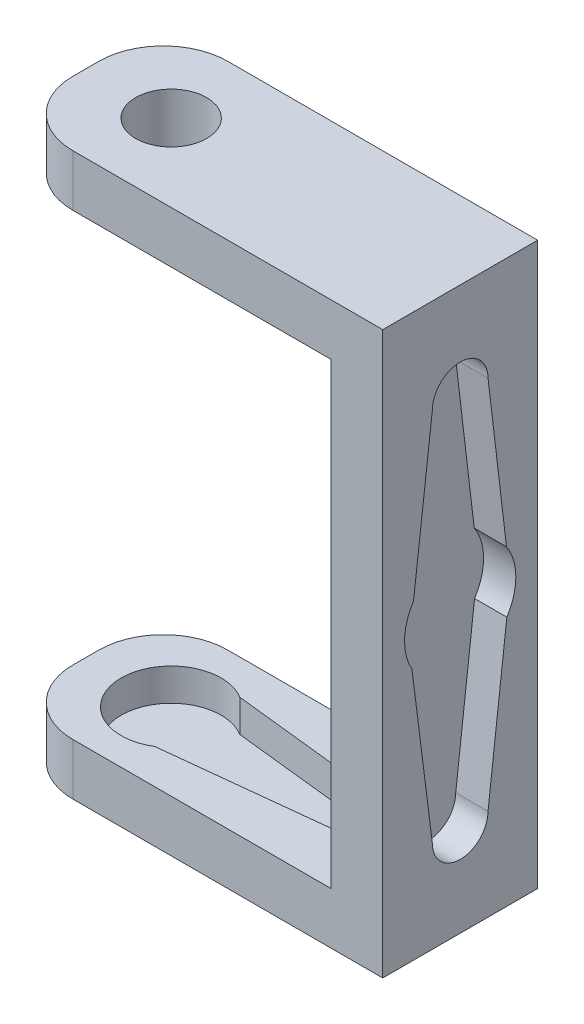
ISO-10303-21;
HEADER;
FILE_DESCRIPTION(('STEP AP214'),'2;1');
FILE_NAME('part.step','',(''),(''),'','','');
FILE_SCHEMA(('AUTOMOTIVE_DESIGN { 1 0 10303 214 1 1 1 1 }'));
ENDSEC;
DATA;
#1=APPLICATION_CONTEXT('core data for automotive mechanical design processes');
#2=APPLICATION_PROTOCOL_DEFINITION('international standard','automotive_design',2000,#1);
#3=PRODUCT_CONTEXT('',#1,'mechanical');
#4=PRODUCT('Part','Part','',(#3));
#5=PRODUCT_RELATED_PRODUCT_CATEGORY('part','',(#4));
#6=PRODUCT_DEFINITION_FORMATION('','',#4);
#7=PRODUCT_DEFINITION_CONTEXT('part definition',#1,'design');
#8=PRODUCT_DEFINITION('design','',#6,#7);
#9=PRODUCT_DEFINITION_SHAPE('','',#8);
#10=(LENGTH_UNIT() NAMED_UNIT(*) SI_UNIT(.MILLI.,.METRE.));
#11=(NAMED_UNIT(*) PLANE_ANGLE_UNIT() SI_UNIT($,.RADIAN.));
#12=(NAMED_UNIT(*) SI_UNIT($,.STERADIAN.) SOLID_ANGLE_UNIT());
#13=UNCERTAINTY_MEASURE_WITH_UNIT(LENGTH_MEASURE(1.E-05),#10,'distance_accuracy_value','');
#14=(GEOMETRIC_REPRESENTATION_CONTEXT(3) GLOBAL_UNCERTAINTY_ASSIGNED_CONTEXT((#13)) GLOBAL_UNIT_ASSIGNED_CONTEXT((#10,
#11,#12)) REPRESENTATION_CONTEXT('',''));
#15=CARTESIAN_POINT('',(0.,0.,0.));
#16=DIRECTION('',(0.,0.,1.));
#17=DIRECTION('',(1.,0.,0.));
#18=AXIS2_PLACEMENT_3D('',#15,#16,#17);
#19=CARTESIAN_POINT('',(-6.60918624296569,-4.,-6.));
#20=DIRECTION('',(-1.,0.,0.));
#21=DIRECTION('',(0.,0.,1.));
#22=AXIS2_PLACEMENT_3D('',#19,#20,#21);
#23=PLANE('',#22);
#24=DIRECTION('',(0.,0.,1.));
#25=VECTOR('',#24,1.);
#26=CARTESIAN_POINT('',(-6.60918624296569,-4.,-6.));
#27=LINE('',#26,#25);
#28=CARTESIAN_POINT('',(-6.60918624296569,-4.,-0.999999999999999));
#29=VERTEX_POINT('',#28);
#30=CARTESIAN_POINT('',(-6.60918624296569,-4.,1.));
#31=VERTEX_POINT('',#30);
#32=EDGE_CURVE('E340',#29,#31,#27,.T.);
#33=ORIENTED_EDGE('',*,*,#32,.T.);
#34=DIRECTION('',(0.,1.,0.));
#35=VECTOR('',#34,1.);
#36=CARTESIAN_POINT('',(-6.60918624296569,-4.,1.));
#37=LINE('',#36,#35);
#38=CARTESIAN_POINT('',(-6.60918624296569,0.,1.));
#39=VERTEX_POINT('',#38);
#40=EDGE_CURVE('E382',#31,#39,#37,.T.);
#41=ORIENTED_EDGE('',*,*,#40,.T.);
#42=DIRECTION('',(0.,0.,1.));
#43=VECTOR('',#42,1.);
#44=CARTESIAN_POINT('',(-6.60918624296569,0.,-6.));
#45=LINE('',#44,#43);
#46=CARTESIAN_POINT('',(-6.60918624296569,0.,-0.999999999999999));
#47=VERTEX_POINT('',#46);
#48=EDGE_CURVE('E333',#47,#39,#45,.T.);
#49=ORIENTED_EDGE('',*,*,#48,.F.);
#50=DIRECTION('',(0.,1.,0.));
#51=VECTOR('',#50,1.);
#52=CARTESIAN_POINT('',(-6.60918624296569,-4.,-0.999999999999999));
#53=LINE('',#52,#51);
#54=EDGE_CURVE('E380',#47,#29,#53,.F.);
#55=ORIENTED_EDGE('',*,*,#54,.T.);
#56=EDGE_LOOP('',(#33,#41,#49,#55));
#57=FACE_BOUND('',#56,.T.);
#58=ADVANCED_FACE('F33',(#57),#23,.T.);
#59=CARTESIAN_POINT('',(-6.60918624296569,-4.,-6.));
#60=DIRECTION('',(0.,0.,-1.));
#61=DIRECTION('',(-1.,0.,0.));
#62=AXIS2_PLACEMENT_3D('',#59,#60,#61);
#63=PLANE('',#62);
#64=DIRECTION('',(-1.,0.,0.));
#65=VECTOR('',#64,1.);
#66=CARTESIAN_POINT('',(18.3908137570343,35.5,-6.));
#67=LINE('',#66,#65);
#68=CARTESIAN_POINT('',(18.3908137570343,35.5,-6.));
#69=VERTEX_POINT('',#68);
#70=CARTESIAN_POINT('',(-1.60918624296568,35.5,-6.));
#71=VERTEX_POINT('',#70);
#72=EDGE_CURVE('E280',#69,#71,#67,.T.);
#73=ORIENTED_EDGE('',*,*,#72,.T.);
#74=DIRECTION('',(0.,1.,0.));
#75=VECTOR('',#74,1.);
#76=CARTESIAN_POINT('',(-1.60918624296569,-4.,-6.));
#77=LINE('',#76,#75);
#78=CARTESIAN_POINT('',(-1.60918624296568,39.5,-6.));
#79=VERTEX_POINT('',#78);
#80=EDGE_CURVE('E377',#71,#79,#77,.T.);
#81=ORIENTED_EDGE('',*,*,#80,.T.);
#82=DIRECTION('',(1.,0.,0.));
#83=VECTOR('',#82,1.);
#84=CARTESIAN_POINT('',(18.3908137570343,39.5,-6.));
#85=LINE('',#84,#83);
#86=CARTESIAN_POINT('',(22.3908137570343,39.5,-6.));
#87=VERTEX_POINT('',#86);
#88=EDGE_CURVE('E286',#79,#87,#85,.T.);
#89=ORIENTED_EDGE('',*,*,#88,.T.);
#90=DIRECTION('',(0.,-1.,0.));
#91=VECTOR('',#90,1.);
#92=CARTESIAN_POINT('',(22.3908137570343,39.5,-6.));
#93=LINE('',#92,#91);
#94=CARTESIAN_POINT('',(22.3908137570343,-4.,-6.));
#95=VERTEX_POINT('',#94);
#96=EDGE_CURVE('E304',#87,#95,#93,.T.);
#97=ORIENTED_EDGE('',*,*,#96,.T.);
#98=DIRECTION('',(-1.,0.,0.));
#99=VECTOR('',#98,1.);
#100=CARTESIAN_POINT('',(-6.60918624296569,-4.,-6.));
#101=LINE('',#100,#99);
#102=CARTESIAN_POINT('',(-1.60918624296569,-4.,-6.));
#103=VERTEX_POINT('',#102);
#104=EDGE_CURVE('E345',#95,#103,#101,.T.);
#105=ORIENTED_EDGE('',*,*,#104,.T.);
#106=DIRECTION('',(0.,1.,0.));
#107=VECTOR('',#106,1.);
#108=CARTESIAN_POINT('',(-1.60918624296569,-4.,-6.));
#109=LINE('',#108,#107);
#110=CARTESIAN_POINT('',(-1.60918624296569,0.,-6.));
#111=VERTEX_POINT('',#110);
#112=EDGE_CURVE('E374',#103,#111,#109,.T.);
#113=ORIENTED_EDGE('',*,*,#112,.T.);
#114=DIRECTION('',(-1.,0.,0.));
#115=VECTOR('',#114,1.);
#116=CARTESIAN_POINT('',(-6.60918624296569,0.,-6.));
#117=LINE('',#116,#115);
#118=CARTESIAN_POINT('',(18.3908137570343,0.,-6.));
#119=VERTEX_POINT('',#118);
#120=EDGE_CURVE('E343',#119,#111,#117,.T.);
#121=ORIENTED_EDGE('',*,*,#120,.F.);
#122=DIRECTION('',(0.,-1.,0.));
#123=VECTOR('',#122,1.);
#124=CARTESIAN_POINT('',(18.3908137570343,39.5,-6.));
#125=LINE('',#124,#123);
#126=EDGE_CURVE('E294',#69,#119,#125,.T.);
#127=ORIENTED_EDGE('',*,*,#126,.F.);
#128=EDGE_LOOP('',(#73,#81,#89,#97,#105,#113,#121,#127));
#129=FACE_BOUND('',#128,.T.);
#130=ADVANCED_FACE('F394',(#129),#63,.T.);
#131=CARTESIAN_POINT('',(-6.60918624296569,-4.,6.));
#132=DIRECTION('',(0.,0.,1.));
#133=DIRECTION('',(1.,0.,0.));
#134=AXIS2_PLACEMENT_3D('',#131,#132,#133);
#135=PLANE('',#134);
#136=DIRECTION('',(-1.,0.,0.));
#137=VECTOR('',#136,1.);
#138=CARTESIAN_POINT('',(18.3908137570343,39.5,6.));
#139=LINE('',#138,#137);
#140=CARTESIAN_POINT('',(22.3908137570343,39.5,6.));
#141=VERTEX_POINT('',#140);
#142=CARTESIAN_POINT('',(-1.60918624296568,39.5,6.));
#143=VERTEX_POINT('',#142);
#144=EDGE_CURVE('E291',#141,#143,#139,.T.);
#145=ORIENTED_EDGE('',*,*,#144,.T.);
#146=DIRECTION('',(0.,1.,0.));
#147=VECTOR('',#146,1.);
#148=CARTESIAN_POINT('',(-1.60918624296569,-4.,6.));
#149=LINE('',#148,#147);
#150=CARTESIAN_POINT('',(-1.60918624296568,35.5,6.));
#151=VERTEX_POINT('',#150);
#152=EDGE_CURVE('E368',#143,#151,#149,.F.);
#153=ORIENTED_EDGE('',*,*,#152,.T.);
#154=DIRECTION('',(-1.,0.,0.));
#155=VECTOR('',#154,1.);
#156=CARTESIAN_POINT('',(18.3908137570343,35.5,6.));
#157=LINE('',#156,#155);
#158=CARTESIAN_POINT('',(18.3908137570343,35.5,6.));
#159=VERTEX_POINT('',#158);
#160=EDGE_CURVE('E274',#159,#151,#157,.T.);
#161=ORIENTED_EDGE('',*,*,#160,.F.);
#162=DIRECTION('',(0.,-1.,0.));
#163=VECTOR('',#162,1.);
#164=CARTESIAN_POINT('',(18.3908137570343,39.5,6.));
#165=LINE('',#164,#163);
#166=CARTESIAN_POINT('',(18.3908137570343,0.,6.));
#167=VERTEX_POINT('',#166);
#168=EDGE_CURVE('E297',#159,#167,#165,.T.);
#169=ORIENTED_EDGE('',*,*,#168,.T.);
#170=DIRECTION('',(1.,0.,0.));
#171=VECTOR('',#170,1.);
#172=CARTESIAN_POINT('',(-6.60918624296569,0.,6.));
#173=LINE('',#172,#171);
#174=CARTESIAN_POINT('',(-1.60918624296569,0.,6.));
#175=VERTEX_POINT('',#174);
#176=EDGE_CURVE('E351',#175,#167,#173,.T.);
#177=ORIENTED_EDGE('',*,*,#176,.F.);
#178=DIRECTION('',(0.,1.,0.));
#179=VECTOR('',#178,1.);
#180=CARTESIAN_POINT('',(-1.60918624296569,-4.,6.));
#181=LINE('',#180,#179);
#182=CARTESIAN_POINT('',(-1.60918624296569,-4.,6.));
#183=VERTEX_POINT('',#182);
#184=EDGE_CURVE('E366',#175,#183,#181,.F.);
#185=ORIENTED_EDGE('',*,*,#184,.T.);
#186=DIRECTION('',(1.,0.,0.));
#187=VECTOR('',#186,1.);
#188=CARTESIAN_POINT('',(-6.60918624296569,-4.,6.));
#189=LINE('',#188,#187);
#190=CARTESIAN_POINT('',(22.3908137570343,-4.,6.));
#191=VERTEX_POINT('',#190);
#192=EDGE_CURVE('E342',#183,#191,#189,.T.);
#193=ORIENTED_EDGE('',*,*,#192,.T.);
#194=DIRECTION('',(0.,-1.,0.));
#195=VECTOR('',#194,1.);
#196=CARTESIAN_POINT('',(22.3908137570343,39.5,6.));
#197=LINE('',#196,#195);
#198=EDGE_CURVE('E301',#141,#191,#197,.T.);
#199=ORIENTED_EDGE('',*,*,#198,.F.);
#200=EDGE_LOOP('',(#145,#153,#161,#169,#177,#185,#193,#199));
#201=FACE_BOUND('',#200,.T.);
#202=ADVANCED_FACE('F408',(#201),#135,.T.);
#203=CARTESIAN_POINT('',(0.,-4.,0.));
#204=DIRECTION('',(0.,1.,0.));
#205=DIRECTION('',(0.,0.,1.));
#206=AXIS2_PLACEMENT_3D('',#203,#204,#205);
#207=PLANE('',#206);
#208=ORIENTED_EDGE('',*,*,#192,.F.);
#209=CARTESIAN_POINT('',(-1.60918624296569,-4.,1.));
#210=DIRECTION('',(0.,1.,0.));
#211=DIRECTION('',(0.,0.,1.));
#212=AXIS2_PLACEMENT_3D('',#209,#210,#211);
#213=CIRCLE('',#212,5.);
#214=EDGE_CURVE('E11',#183,#31,#213,.F.);
#215=ORIENTED_EDGE('',*,*,#214,.T.);
#216=ORIENTED_EDGE('',*,*,#32,.F.);
#217=CARTESIAN_POINT('',(-1.60918624296569,-4.,-1.));
#218=DIRECTION('',(0.,1.,0.));
#219=DIRECTION('',(0.,0.,1.));
#220=AXIS2_PLACEMENT_3D('',#217,#218,#219);
#221=CIRCLE('',#220,5.);
#222=EDGE_CURVE('E41',#29,#103,#221,.F.);
#223=ORIENTED_EDGE('',*,*,#222,.T.);
#224=ORIENTED_EDGE('',*,*,#104,.F.);
#225=DIRECTION('',(0.,0.,1.));
#226=VECTOR('',#225,1.);
#227=CARTESIAN_POINT('',(22.3908137570343,-4.,6.));
#228=LINE('',#227,#226);
#229=EDGE_CURVE('E283',#95,#191,#228,.T.);
#230=ORIENTED_EDGE('',*,*,#229,.T.);
#231=EDGE_LOOP('',(#208,#215,#216,#223,#224,#230));
#232=FACE_BOUND('',#231,.T.);
#233=ADVANCED_FACE('F389',(#232),#207,.F.);
#234=CARTESIAN_POINT('',(0.,0.,0.));
#235=DIRECTION('',(0.,1.,0.));
#236=DIRECTION('',(0.,0.,1.));
#237=AXIS2_PLACEMENT_3D('',#234,#235,#236);
#238=PLANE('',#237);
#239=CARTESIAN_POINT('',(14.254126853945,0.,0.));
#240=DIRECTION('',(0.,1.,0.));
#241=DIRECTION('',(0.,0.,1.));
#242=AXIS2_PLACEMENT_3D('',#239,#240,#241);
#243=CIRCLE('',#242,1.96240815597465);
#244=CARTESIAN_POINT('',(14.254126853945,0.,1.96240815597465));
#245=VERTEX_POINT('',#244);
#246=CARTESIAN_POINT('',(14.254126853945,0.,-1.96240815597465));
#247=VERTEX_POINT('',#246);
#248=EDGE_CURVE('E300',#245,#247,#243,.T.);
#249=ORIENTED_EDGE('',*,*,#248,.F.);
#250=DIRECTION('',(0.994069597814504,0.,-0.108745734173391));
#251=VECTOR('',#250,1.);
#252=CARTESIAN_POINT('',(14.254126853945,0.,1.96240815597465));
#253=LINE('',#252,#251);
#254=CARTESIAN_POINT('',(2.0290903736251,0.,3.29975975617614));
#255=VERTEX_POINT('',#254);
#256=EDGE_CURVE('E312',#255,#245,#253,.T.);
#257=ORIENTED_EDGE('',*,*,#256,.F.);
#258=CARTESIAN_POINT('',(0.,0.,0.));
#259=DIRECTION('',(0.,1.,0.));
#260=DIRECTION('',(0.,0.,1.));
#261=AXIS2_PLACEMENT_3D('',#258,#259,#260);
#262=CIRCLE('',#261,3.87370910018004);
#263=CARTESIAN_POINT('',(2.0290903736251,0.,-3.29975975617614));
#264=VERTEX_POINT('',#263);
#265=EDGE_CURVE('E326',#264,#255,#262,.T.);
#266=ORIENTED_EDGE('',*,*,#265,.F.);
#267=DIRECTION('',(-0.994069597814504,0.,-0.108745734173391));
#268=VECTOR('',#267,1.);
#269=CARTESIAN_POINT('',(14.254126853945,0.,-1.96240815597465));
#270=LINE('',#269,#268);
#271=EDGE_CURVE('E323',#247,#264,#270,.T.);
#272=ORIENTED_EDGE('',*,*,#271,.F.);
#273=EDGE_LOOP('',(#249,#257,#266,#272));
#274=FACE_BOUND('',#273,.T.);
#275=ORIENTED_EDGE('',*,*,#48,.T.);
#276=CARTESIAN_POINT('',(-1.60918624296569,0.,1.));
#277=DIRECTION('',(0.,1.,0.));
#278=DIRECTION('',(0.,0.,1.));
#279=AXIS2_PLACEMENT_3D('',#276,#277,#278);
#280=CIRCLE('',#279,5.);
#281=EDGE_CURVE('E387',#39,#175,#280,.T.);
#282=ORIENTED_EDGE('',*,*,#281,.T.);
#283=ORIENTED_EDGE('',*,*,#176,.T.);
#284=DIRECTION('',(0.,0.,-1.));
#285=VECTOR('',#284,1.);
#286=CARTESIAN_POINT('',(18.3908137570343,0.,-6.));
#287=LINE('',#286,#285);
#288=EDGE_CURVE('E353',#167,#119,#287,.T.);
#289=ORIENTED_EDGE('',*,*,#288,.T.);
#290=ORIENTED_EDGE('',*,*,#120,.T.);
#291=CARTESIAN_POINT('',(-1.60918624296569,0.,-1.));
#292=DIRECTION('',(0.,1.,0.));
#293=DIRECTION('',(0.,0.,1.));
#294=AXIS2_PLACEMENT_3D('',#291,#292,#293);
#295=CIRCLE('',#294,5.);
#296=EDGE_CURVE('E385',#111,#47,#295,.T.);
#297=ORIENTED_EDGE('',*,*,#296,.T.);
#298=EDGE_LOOP('',(#275,#282,#283,#289,#290,#297));
#299=FACE_BOUND('',#298,.T.);
#300=ADVANCED_FACE('F400',(#274,#299),#238,.T.);
#301=CARTESIAN_POINT('',(14.254126853945,-2.5,0.));
#302=DIRECTION('',(0.,1.,0.));
#303=DIRECTION('',(0.,0.,1.));
#304=AXIS2_PLACEMENT_3D('',#301,#302,#303);
#305=CYLINDRICAL_SURFACE('',#304,1.96240815597465);
#306=ORIENTED_EDGE('',*,*,#248,.T.);
#307=DIRECTION('',(0.,1.,0.));
#308=VECTOR('',#307,1.);
#309=CARTESIAN_POINT('',(14.254126853945,-2.5,-1.96240815597465));
#310=LINE('',#309,#308);
#311=CARTESIAN_POINT('',(14.254126853945,-2.5,-1.96240815597465));
#312=VERTEX_POINT('',#311);
#313=EDGE_CURVE('E321',#312,#247,#310,.T.);
#314=ORIENTED_EDGE('',*,*,#313,.F.);
#315=CARTESIAN_POINT('',(14.254126853945,-2.5,0.));
#316=DIRECTION('',(0.,1.,0.));
#317=DIRECTION('',(0.,0.,1.));
#318=AXIS2_PLACEMENT_3D('',#315,#316,#317);
#319=CIRCLE('',#318,1.96240815597465);
#320=CARTESIAN_POINT('',(14.254126853945,-2.5,1.96240815597465));
#321=VERTEX_POINT('',#320);
#322=EDGE_CURVE('E308',#321,#312,#319,.T.);
#323=ORIENTED_EDGE('',*,*,#322,.F.);
#324=DIRECTION('',(0.,1.,0.));
#325=VECTOR('',#324,1.);
#326=CARTESIAN_POINT('',(14.254126853945,-2.5,1.96240815597465));
#327=LINE('',#326,#325);
#328=EDGE_CURVE('E331',#321,#245,#327,.T.);
#329=ORIENTED_EDGE('',*,*,#328,.T.);
#330=EDGE_LOOP('',(#306,#314,#323,#329));
#331=FACE_BOUND('',#330,.T.);
#332=ADVANCED_FACE('F629',(#331),#305,.F.);
#333=CARTESIAN_POINT('',(14.254126853945,-2.5,1.96240815597465));
#334=DIRECTION('',(0.108745734173391,0.,0.994069597814504));
#335=DIRECTION('',(0.994069597814504,0.,-0.108745734173391));
#336=AXIS2_PLACEMENT_3D('',#333,#334,#335);
#337=PLANE('',#336);
#338=ORIENTED_EDGE('',*,*,#256,.T.);
#339=ORIENTED_EDGE('',*,*,#328,.F.);
#340=DIRECTION('',(0.994069597814504,0.,-0.108745734173391));
#341=VECTOR('',#340,1.);
#342=CARTESIAN_POINT('',(14.254126853945,-2.5,1.96240815597465));
#343=LINE('',#342,#341);
#344=CARTESIAN_POINT('',(2.0290903736251,-2.5,3.29975975617614));
#345=VERTEX_POINT('',#344);
#346=EDGE_CURVE('E318',#345,#321,#343,.T.);
#347=ORIENTED_EDGE('',*,*,#346,.F.);
#348=DIRECTION('',(0.,1.,0.));
#349=VECTOR('',#348,1.);
#350=CARTESIAN_POINT('',(2.0290903736251,-2.5,3.29975975617614));
#351=LINE('',#350,#349);
#352=EDGE_CURVE('E334',#345,#255,#351,.T.);
#353=ORIENTED_EDGE('',*,*,#352,.T.);
#354=EDGE_LOOP('',(#338,#339,#347,#353));
#355=FACE_BOUND('',#354,.T.);
#356=ADVANCED_FACE('F699',(#355),#337,.F.);
#357=CARTESIAN_POINT('',(0.,-2.5,0.));
#358=DIRECTION('',(0.,1.,0.));
#359=DIRECTION('',(0.,0.,1.));
#360=AXIS2_PLACEMENT_3D('',#357,#358,#359);
#361=CYLINDRICAL_SURFACE('',#360,3.87370910018004);
#362=ORIENTED_EDGE('',*,*,#265,.T.);
#363=ORIENTED_EDGE('',*,*,#352,.F.);
#364=CARTESIAN_POINT('',(0.,-2.5,0.));
#365=DIRECTION('',(0.,1.,0.));
#366=DIRECTION('',(0.,0.,1.));
#367=AXIS2_PLACEMENT_3D('',#364,#365,#366);
#368=CIRCLE('',#367,3.87370910018004);
#369=CARTESIAN_POINT('',(2.0290903736251,-2.5,-3.29975975617614));
#370=VERTEX_POINT('',#369);
#371=EDGE_CURVE('E315',#370,#345,#368,.T.);
#372=ORIENTED_EDGE('',*,*,#371,.F.);
#373=DIRECTION('',(0.,1.,0.));
#374=VECTOR('',#373,1.);
#375=CARTESIAN_POINT('',(2.0290903736251,-2.5,-3.29975975617614));
#376=LINE('',#375,#374);
#377=EDGE_CURVE('E336',#370,#264,#376,.T.);
#378=ORIENTED_EDGE('',*,*,#377,.T.);
#379=EDGE_LOOP('',(#362,#363,#372,#378));
#380=FACE_BOUND('',#379,.T.);
#381=ADVANCED_FACE('F690',(#380),#361,.F.);
#382=CARTESIAN_POINT('',(14.254126853945,-2.5,-1.96240815597465));
#383=DIRECTION('',(0.108745734173391,0.,-0.994069597814504));
#384=DIRECTION('',(-0.994069597814504,0.,-0.108745734173391));
#385=AXIS2_PLACEMENT_3D('',#382,#383,#384);
#386=PLANE('',#385);
#387=ORIENTED_EDGE('',*,*,#271,.T.);
#388=ORIENTED_EDGE('',*,*,#377,.F.);
#389=DIRECTION('',(-0.994069597814504,0.,-0.108745734173391));
#390=VECTOR('',#389,1.);
#391=CARTESIAN_POINT('',(14.254126853945,-2.5,-1.96240815597465));
#392=LINE('',#391,#390);
#393=EDGE_CURVE('E311',#312,#370,#392,.T.);
#394=ORIENTED_EDGE('',*,*,#393,.F.);
#395=ORIENTED_EDGE('',*,*,#313,.T.);
#396=EDGE_LOOP('',(#387,#388,#394,#395));
#397=FACE_BOUND('',#396,.T.);
#398=ADVANCED_FACE('F681',(#397),#386,.F.);
#399=CARTESIAN_POINT('',(14.254126853945,-2.5,0.));
#400=DIRECTION('',(0.,1.,0.));
#401=DIRECTION('',(0.,0.,1.));
#402=AXIS2_PLACEMENT_3D('',#399,#400,#401);
#403=PLANE('',#402);
#404=ORIENTED_EDGE('',*,*,#322,.T.);
#405=ORIENTED_EDGE('',*,*,#393,.T.);
#406=ORIENTED_EDGE('',*,*,#371,.T.);
#407=ORIENTED_EDGE('',*,*,#346,.T.);
#408=EDGE_LOOP('',(#404,#405,#406,#407));
#409=FACE_BOUND('',#408,.T.);
#410=ADVANCED_FACE('F676',(#409),#403,.T.);
#411=CARTESIAN_POINT('',(18.3908137570343,39.5,6.));
#412=DIRECTION('',(-1.,0.,0.));
#413=DIRECTION('',(0.,0.,1.));
#414=AXIS2_PLACEMENT_3D('',#411,#412,#413);
#415=PLANE('',#414);
#416=DIRECTION('',(0.,0.,1.));
#417=VECTOR('',#416,1.);
#418=CARTESIAN_POINT('',(18.3908137570343,35.5,-6.));
#419=LINE('',#418,#417);
#420=EDGE_CURVE('E271',#69,#159,#419,.T.);
#421=ORIENTED_EDGE('',*,*,#420,.F.);
#422=ORIENTED_EDGE('',*,*,#126,.T.);
#423=ORIENTED_EDGE('',*,*,#288,.F.);
#424=ORIENTED_EDGE('',*,*,#168,.F.);
#425=EDGE_LOOP('',(#421,#422,#423,#424));
#426=FACE_BOUND('',#425,.T.);
#427=ADVANCED_FACE('F412',(#426),#415,.T.);
#428=CARTESIAN_POINT('',(22.3908137570343,39.5,6.));
#429=DIRECTION('',(1.,0.,0.));
#430=DIRECTION('',(0.,0.,-1.));
#431=AXIS2_PLACEMENT_3D('',#428,#429,#430);
#432=PLANE('',#431);
#433=CARTESIAN_POINT('',(22.3908137570343,32.1715615077074,-0.000957170949016659));
#434=DIRECTION('',(1.,0.,0.));
#435=DIRECTION('',(0.,0.,-1.));
#436=AXIS2_PLACEMENT_3D('',#433,#434,#435);
#437=CIRCLE('',#436,2.15547877510888);
#438=CARTESIAN_POINT('',(22.3908137570343,32.1715615077074,-2.1564359460579));
#439=VERTEX_POINT('',#438);
#440=CARTESIAN_POINT('',(22.3908137570343,32.1715615077074,2.15452160415987));
#441=VERTEX_POINT('',#440);
#442=EDGE_CURVE('E48',#439,#441,#437,.T.);
#443=ORIENTED_EDGE('',*,*,#442,.F.);
#444=DIRECTION('',(0.,0.99299643189618,0.118144344940653));
#445=VECTOR('',#444,1.);
#446=CARTESIAN_POINT('',(22.3908137570343,20.1409380884809,-3.58781080042474));
#447=LINE('',#446,#445);
#448=CARTESIAN_POINT('',(22.3908137570343,20.1409380884809,-3.58781080042474));
#449=VERTEX_POINT('',#448);
#450=EDGE_CURVE('E215',#449,#439,#447,.T.);
#451=ORIENTED_EDGE('',*,*,#450,.F.);
#452=CARTESIAN_POINT('',(22.3908137570343,17.75,0.));
#453=DIRECTION('',(1.,0.,0.));
#454=DIRECTION('',(0.,0.,-1.));
#455=AXIS2_PLACEMENT_3D('',#452,#453,#454);
#456=CIRCLE('',#455,4.31149292966986);
#457=CARTESIAN_POINT('',(22.3908137570343,15.4008702448282,-3.61532303894961));
#458=VERTEX_POINT('',#457);
#459=EDGE_CURVE('E218',#458,#449,#456,.T.);
#460=ORIENTED_EDGE('',*,*,#459,.F.);
#461=DIRECTION('',(0.,0.993029565831886,-0.117865522455619));
#462=VECTOR('',#461,1.);
#463=CARTESIAN_POINT('',(22.3908137570343,3.10959128326855,-2.1564359460579));
#464=LINE('',#463,#462);
#465=CARTESIAN_POINT('',(22.3908137570343,3.10959128326855,-2.1564359460579));
#466=VERTEX_POINT('',#465);
#467=EDGE_CURVE('E246',#466,#458,#464,.T.);
#468=ORIENTED_EDGE('',*,*,#467,.F.);
#469=CARTESIAN_POINT('',(22.3908137570343,3.10959128326855,-0.000957170949016659));
#470=DIRECTION('',(1.,0.,0.));
#471=DIRECTION('',(0.,0.,-1.));
#472=AXIS2_PLACEMENT_3D('',#469,#470,#471);
#473=CIRCLE('',#472,2.15547877510888);
#474=CARTESIAN_POINT('',(22.3908137570343,3.10959128326855,2.15452160415987));
#475=VERTEX_POINT('',#474);
#476=EDGE_CURVE('E243',#475,#466,#473,.T.);
#477=ORIENTED_EDGE('',*,*,#476,.F.);
#478=DIRECTION('',(0.,-0.992057442808634,-0.125785651677738));
#479=VECTOR('',#478,1.);
#480=CARTESIAN_POINT('',(22.3908137570343,15.6023212419307,3.73850869127397));
#481=LINE('',#480,#479);
#482=CARTESIAN_POINT('',(22.3908137570343,15.6023212419307,3.73850869127397));
#483=VERTEX_POINT('',#482);
#484=EDGE_CURVE('E240',#483,#475,#481,.T.);
#485=ORIENTED_EDGE('',*,*,#484,.F.);
#486=CARTESIAN_POINT('',(22.3908137570343,17.75,0.));
#487=DIRECTION('',(1.,0.,0.));
#488=DIRECTION('',(0.,0.,-1.));
#489=AXIS2_PLACEMENT_3D('',#486,#487,#488);
#490=CIRCLE('',#489,4.31149292966986);
#491=CARTESIAN_POINT('',(22.3908137570343,20.0991297551718,3.61532303894959));
#492=VERTEX_POINT('',#491);
#493=EDGE_CURVE('E237',#492,#483,#490,.T.);
#494=ORIENTED_EDGE('',*,*,#493,.F.);
#495=DIRECTION('',(0.,-0.99275855148085,0.120126843218509));
#496=VECTOR('',#495,1.);
#497=CARTESIAN_POINT('',(22.3908137570343,32.1715615077074,2.15452160415987));
#498=LINE('',#497,#496);
#499=EDGE_CURVE('E235',#441,#492,#498,.T.);
#500=ORIENTED_EDGE('',*,*,#499,.F.);
#501=EDGE_LOOP('',(#443,#451,#460,#468,#477,#485,#494,#500));
#502=FACE_BOUND('',#501,.T.);
#503=ORIENTED_EDGE('',*,*,#229,.F.);
#504=ORIENTED_EDGE('',*,*,#96,.F.);
#505=DIRECTION('',(0.,0.,1.));
#506=VECTOR('',#505,1.);
#507=CARTESIAN_POINT('',(22.3908137570343,39.5,6.));
#508=LINE('',#507,#506);
#509=EDGE_CURVE('E288',#87,#141,#508,.T.);
#510=ORIENTED_EDGE('',*,*,#509,.T.);
#511=ORIENTED_EDGE('',*,*,#198,.T.);
#512=EDGE_LOOP('',(#503,#504,#510,#511));
#513=FACE_BOUND('',#512,.T.);
#514=ADVANCED_FACE('F430',(#502,#513),#432,.T.);
#515=CARTESIAN_POINT('',(0.,39.5,0.));
#516=DIRECTION('',(0.,-1.,0.));
#517=DIRECTION('',(0.,0.,-1.));
#518=AXIS2_PLACEMENT_3D('',#515,#516,#517);
#519=PLANE('',#518);
#520=CARTESIAN_POINT('',(0.,39.5,0.));
#521=DIRECTION('',(0.,1.,0.));
#522=DIRECTION('',(0.,0.,1.));
#523=AXIS2_PLACEMENT_3D('',#520,#521,#522);
#524=CIRCLE('',#523,2.75);
#525=CARTESIAN_POINT('',(0.,39.5,2.75));
#526=VERTEX_POINT('',#525);
#527=EDGE_CURVE('E253',#526,#526,#524,.T.);
#528=ORIENTED_EDGE('',*,*,#527,.F.);
#529=EDGE_LOOP('',(#528));
#530=FACE_BOUND('',#529,.T.);
#531=DIRECTION('',(0.,0.,1.));
#532=VECTOR('',#531,1.);
#533=CARTESIAN_POINT('',(-6.60918624296569,39.5,-6.));
#534=LINE('',#533,#532);
#535=CARTESIAN_POINT('',(-6.60918624296569,39.5,-1.));
#536=VERTEX_POINT('',#535);
#537=CARTESIAN_POINT('',(-6.60918624296569,39.5,1.));
#538=VERTEX_POINT('',#537);
#539=EDGE_CURVE('E268',#536,#538,#534,.T.);
#540=ORIENTED_EDGE('',*,*,#539,.T.);
#541=CARTESIAN_POINT('',(-1.60918624296569,39.5,1.));
#542=DIRECTION('',(0.,-1.,0.));
#543=DIRECTION('',(0.,0.,-1.));
#544=AXIS2_PLACEMENT_3D('',#541,#542,#543);
#545=CIRCLE('',#544,5.);
#546=EDGE_CURVE('E364',#538,#143,#545,.F.);
#547=ORIENTED_EDGE('',*,*,#546,.T.);
#548=ORIENTED_EDGE('',*,*,#144,.F.);
#549=ORIENTED_EDGE('',*,*,#509,.F.);
#550=ORIENTED_EDGE('',*,*,#88,.F.);
#551=CARTESIAN_POINT('',(-1.60918624296569,39.5,-1.));
#552=DIRECTION('',(0.,-1.,0.));
#553=DIRECTION('',(0.,0.,-1.));
#554=AXIS2_PLACEMENT_3D('',#551,#552,#553);
#555=CIRCLE('',#554,5.);
#556=EDGE_CURVE('E362',#79,#536,#555,.F.);
#557=ORIENTED_EDGE('',*,*,#556,.T.);
#558=EDGE_LOOP('',(#540,#547,#548,#549,#550,#557));
#559=FACE_BOUND('',#558,.T.);
#560=ADVANCED_FACE('F426',(#530,#559),#519,.F.);
#561=CARTESIAN_POINT('',(-6.60918624296569,35.5,-6.));
#562=DIRECTION('',(-1.,0.,0.));
#563=DIRECTION('',(0.,0.,1.));
#564=AXIS2_PLACEMENT_3D('',#561,#562,#563);
#565=PLANE('',#564);
#566=DIRECTION('',(0.,0.,1.));
#567=VECTOR('',#566,1.);
#568=CARTESIAN_POINT('',(-6.60918624296569,35.5,-6.));
#569=LINE('',#568,#567);
#570=CARTESIAN_POINT('',(-6.60918624296569,35.5,-1.));
#571=VERTEX_POINT('',#570);
#572=CARTESIAN_POINT('',(-6.60918624296569,35.5,1.));
#573=VERTEX_POINT('',#572);
#574=EDGE_CURVE('E277',#571,#573,#569,.T.);
#575=ORIENTED_EDGE('',*,*,#574,.T.);
#576=DIRECTION('',(0.,1.,0.));
#577=VECTOR('',#576,1.);
#578=CARTESIAN_POINT('',(-6.60918624296569,35.5,1.));
#579=LINE('',#578,#577);
#580=EDGE_CURVE('E359',#573,#538,#579,.T.);
#581=ORIENTED_EDGE('',*,*,#580,.T.);
#582=ORIENTED_EDGE('',*,*,#539,.F.);
#583=DIRECTION('',(0.,1.,0.));
#584=VECTOR('',#583,1.);
#585=CARTESIAN_POINT('',(-6.60918624296569,35.5,-1.));
#586=LINE('',#585,#584);
#587=EDGE_CURVE('E348',#536,#571,#586,.F.);
#588=ORIENTED_EDGE('',*,*,#587,.T.);
#589=EDGE_LOOP('',(#575,#581,#582,#588));
#590=FACE_BOUND('',#589,.T.);
#591=ADVANCED_FACE('F437',(#590),#565,.T.);
#592=CARTESIAN_POINT('',(0.,35.5,0.));
#593=DIRECTION('',(0.,-1.,0.));
#594=DIRECTION('',(0.,0.,-1.));
#595=AXIS2_PLACEMENT_3D('',#592,#593,#594);
#596=PLANE('',#595);
#597=CARTESIAN_POINT('',(0.,35.5,0.));
#598=DIRECTION('',(0.,1.,0.));
#599=DIRECTION('',(0.,0.,1.));
#600=AXIS2_PLACEMENT_3D('',#597,#598,#599);
#601=CIRCLE('',#600,2.75);
#602=CARTESIAN_POINT('',(0.,35.5,2.75));
#603=VERTEX_POINT('',#602);
#604=EDGE_CURVE('E265',#603,#603,#601,.T.);
#605=ORIENTED_EDGE('',*,*,#604,.T.);
#606=EDGE_LOOP('',(#605));
#607=FACE_BOUND('',#606,.T.);
#608=ORIENTED_EDGE('',*,*,#160,.T.);
#609=CARTESIAN_POINT('',(-1.60918624296569,35.5,1.));
#610=DIRECTION('',(0.,-1.,0.));
#611=DIRECTION('',(0.,0.,-1.));
#612=AXIS2_PLACEMENT_3D('',#609,#610,#611);
#613=CIRCLE('',#612,5.);
#614=EDGE_CURVE('E372',#151,#573,#613,.T.);
#615=ORIENTED_EDGE('',*,*,#614,.T.);
#616=ORIENTED_EDGE('',*,*,#574,.F.);
#617=CARTESIAN_POINT('',(-1.60918624296569,35.5,-1.));
#618=DIRECTION('',(0.,-1.,0.));
#619=DIRECTION('',(0.,0.,-1.));
#620=AXIS2_PLACEMENT_3D('',#617,#618,#619);
#621=CIRCLE('',#620,5.);
#622=EDGE_CURVE('E370',#571,#71,#621,.T.);
#623=ORIENTED_EDGE('',*,*,#622,.T.);
#624=ORIENTED_EDGE('',*,*,#72,.F.);
#625=ORIENTED_EDGE('',*,*,#420,.T.);
#626=EDGE_LOOP('',(#608,#615,#616,#623,#624,#625));
#627=FACE_BOUND('',#626,.T.);
#628=ADVANCED_FACE('F417',(#607,#627),#596,.T.);
#629=CARTESIAN_POINT('',(0.,35.5,0.));
#630=DIRECTION('',(0.,1.,0.));
#631=DIRECTION('',(0.,0.,1.));
#632=AXIS2_PLACEMENT_3D('',#629,#630,#631);
#633=CYLINDRICAL_SURFACE('',#632,2.75);
#634=ORIENTED_EDGE('',*,*,#604,.F.);
#635=EDGE_LOOP('',(#634));
#636=FACE_BOUND('',#635,.T.);
#637=ORIENTED_EDGE('',*,*,#527,.T.);
#638=EDGE_LOOP('',(#637));
#639=FACE_BOUND('',#638,.T.);
#640=ADVANCED_FACE('F444',(#636,#639),#633,.F.);
#641=CARTESIAN_POINT('',(-1.60918624296569,35.5,1.));
#642=DIRECTION('',(0.,1.,0.));
#643=DIRECTION('',(0.,0.,1.));
#644=AXIS2_PLACEMENT_3D('',#641,#642,#643);
#645=CYLINDRICAL_SURFACE('',#644,5.);
#646=ORIENTED_EDGE('',*,*,#614,.F.);
#647=ORIENTED_EDGE('',*,*,#152,.F.);
#648=ORIENTED_EDGE('',*,*,#546,.F.);
#649=ORIENTED_EDGE('',*,*,#580,.F.);
#650=EDGE_LOOP('',(#646,#647,#648,#649));
#651=FACE_BOUND('',#650,.T.);
#652=ADVANCED_FACE('F434',(#651),#645,.T.);
#653=CARTESIAN_POINT('',(-1.60918624296569,-4.,-1.));
#654=DIRECTION('',(0.,1.,0.));
#655=DIRECTION('',(0.,0.,1.));
#656=AXIS2_PLACEMENT_3D('',#653,#654,#655);
#657=CYLINDRICAL_SURFACE('',#656,5.);
#658=ORIENTED_EDGE('',*,*,#622,.F.);
#659=ORIENTED_EDGE('',*,*,#587,.F.);
#660=ORIENTED_EDGE('',*,*,#556,.F.);
#661=ORIENTED_EDGE('',*,*,#80,.F.);
#662=EDGE_LOOP('',(#658,#659,#660,#661));
#663=FACE_BOUND('',#662,.T.);
#664=ADVANCED_FACE('F422',(#663),#657,.T.);
#665=CARTESIAN_POINT('',(-1.60918624296569,-4.,1.));
#666=DIRECTION('',(0.,1.,0.));
#667=DIRECTION('',(0.,0.,1.));
#668=AXIS2_PLACEMENT_3D('',#665,#666,#667);
#669=CYLINDRICAL_SURFACE('',#668,5.);
#670=ORIENTED_EDGE('',*,*,#214,.F.);
#671=ORIENTED_EDGE('',*,*,#184,.F.);
#672=ORIENTED_EDGE('',*,*,#281,.F.);
#673=ORIENTED_EDGE('',*,*,#40,.F.);
#674=EDGE_LOOP('',(#670,#671,#672,#673));
#675=FACE_BOUND('',#674,.T.);
#676=ADVANCED_FACE('F404',(#675),#669,.T.);
#677=CARTESIAN_POINT('',(-1.60918624296569,-4.,-1.));
#678=DIRECTION('',(0.,1.,0.));
#679=DIRECTION('',(0.,0.,1.));
#680=AXIS2_PLACEMENT_3D('',#677,#678,#679);
#681=CYLINDRICAL_SURFACE('',#680,5.);
#682=ORIENTED_EDGE('',*,*,#222,.F.);
#683=ORIENTED_EDGE('',*,*,#54,.F.);
#684=ORIENTED_EDGE('',*,*,#296,.F.);
#685=ORIENTED_EDGE('',*,*,#112,.F.);
#686=EDGE_LOOP('',(#682,#683,#684,#685));
#687=FACE_BOUND('',#686,.T.);
#688=ADVANCED_FACE('F35',(#687),#681,.T.);
#689=CARTESIAN_POINT('',(19.8908137570343,32.1715615077074,-0.000957170949016659));
#690=DIRECTION('',(1.,0.,0.));
#691=DIRECTION('',(0.,0.,-1.));
#692=AXIS2_PLACEMENT_3D('',#689,#690,#691);
#693=CYLINDRICAL_SURFACE('',#692,2.15547877510888);
#694=ORIENTED_EDGE('',*,*,#442,.T.);
#695=DIRECTION('',(1.,0.,0.));
#696=VECTOR('',#695,1.);
#697=CARTESIAN_POINT('',(19.8908137570343,32.1715615077074,2.15452160415987));
#698=LINE('',#697,#696);
#699=CARTESIAN_POINT('',(19.8908137570343,32.1715615077074,2.15452160415987));
#700=VERTEX_POINT('',#699);
#701=EDGE_CURVE('E192',#700,#441,#698,.T.);
#702=ORIENTED_EDGE('',*,*,#701,.F.);
#703=CARTESIAN_POINT('',(19.8908137570343,32.1715615077074,-0.000957170949016659));
#704=DIRECTION('',(1.,0.,0.));
#705=DIRECTION('',(0.,0.,-1.));
#706=AXIS2_PLACEMENT_3D('',#703,#704,#705);
#707=CIRCLE('',#706,2.15547877510888);
#708=CARTESIAN_POINT('',(19.8908137570343,32.1715615077074,-2.1564359460579));
#709=VERTEX_POINT('',#708);
#710=EDGE_CURVE('E196',#709,#700,#707,.T.);
#711=ORIENTED_EDGE('',*,*,#710,.F.);
#712=DIRECTION('',(1.,0.,0.));
#713=VECTOR('',#712,1.);
#714=CARTESIAN_POINT('',(19.8908137570343,32.1715615077074,-2.1564359460579));
#715=LINE('',#714,#713);
#716=EDGE_CURVE('E251',#709,#439,#715,.T.);
#717=ORIENTED_EDGE('',*,*,#716,.T.);
#718=EDGE_LOOP('',(#694,#702,#711,#717));
#719=FACE_BOUND('',#718,.T.);
#720=ADVANCED_FACE('F194',(#719),#693,.F.);
#721=CARTESIAN_POINT('',(19.8908137570343,20.1409380884809,-3.58781080042474));
#722=DIRECTION('',(0.,0.118144344940653,-0.99299643189618));
#723=DIRECTION('',(0.,0.99299643189618,0.118144344940653));
#724=AXIS2_PLACEMENT_3D('',#721,#722,#723);
#725=PLANE('',#724);
#726=ORIENTED_EDGE('',*,*,#450,.T.);
#727=ORIENTED_EDGE('',*,*,#716,.F.);
#728=DIRECTION('',(0.,0.99299643189618,0.118144344940653));
#729=VECTOR('',#728,1.);
#730=CARTESIAN_POINT('',(19.8908137570343,20.1409380884809,-3.58781080042474));
#731=LINE('',#730,#729);
#732=CARTESIAN_POINT('',(19.8908137570343,20.1409380884809,-3.58781080042474));
#733=VERTEX_POINT('',#732);
#734=EDGE_CURVE('E202',#733,#709,#731,.T.);
#735=ORIENTED_EDGE('',*,*,#734,.F.);
#736=DIRECTION('',(1.,0.,0.));
#737=VECTOR('',#736,1.);
#738=CARTESIAN_POINT('',(19.8908137570343,20.1409380884809,-3.58781080042474));
#739=LINE('',#738,#737);
#740=EDGE_CURVE('E254',#733,#449,#739,.T.);
#741=ORIENTED_EDGE('',*,*,#740,.T.);
#742=EDGE_LOOP('',(#726,#727,#735,#741));
#743=FACE_BOUND('',#742,.T.);
#744=ADVANCED_FACE('F467',(#743),#725,.F.);
#745=CARTESIAN_POINT('',(19.8908137570343,17.75,0.));
#746=DIRECTION('',(1.,0.,0.));
#747=DIRECTION('',(0.,0.,-1.));
#748=AXIS2_PLACEMENT_3D('',#745,#746,#747);
#749=CYLINDRICAL_SURFACE('',#748,4.31149292966986);
#750=ORIENTED_EDGE('',*,*,#459,.T.);
#751=ORIENTED_EDGE('',*,*,#740,.F.);
#752=CARTESIAN_POINT('',(19.8908137570343,17.75,0.));
#753=DIRECTION('',(1.,0.,0.));
#754=DIRECTION('',(0.,0.,-1.));
#755=AXIS2_PLACEMENT_3D('',#752,#753,#754);
#756=CIRCLE('',#755,4.31149292966986);
#757=CARTESIAN_POINT('',(19.8908137570343,15.4008702448282,-3.61532303894961));
#758=VERTEX_POINT('',#757);
#759=EDGE_CURVE('E231',#758,#733,#756,.T.);
#760=ORIENTED_EDGE('',*,*,#759,.F.);
#761=DIRECTION('',(1.,0.,0.));
#762=VECTOR('',#761,1.);
#763=CARTESIAN_POINT('',(19.8908137570343,15.4008702448282,-3.61532303894961));
#764=LINE('',#763,#762);
#765=EDGE_CURVE('E256',#758,#458,#764,.T.);
#766=ORIENTED_EDGE('',*,*,#765,.T.);
#767=EDGE_LOOP('',(#750,#751,#760,#766));
#768=FACE_BOUND('',#767,.T.);
#769=ADVANCED_FACE('F472',(#768),#749,.F.);
#770=CARTESIAN_POINT('',(19.8908137570343,3.10959128326855,-2.1564359460579));
#771=DIRECTION('',(0.,-0.117865522455619,-0.993029565831886));
#772=DIRECTION('',(0.,0.993029565831886,-0.117865522455619));
#773=AXIS2_PLACEMENT_3D('',#770,#771,#772);
#774=PLANE('',#773);
#775=ORIENTED_EDGE('',*,*,#467,.T.);
#776=ORIENTED_EDGE('',*,*,#765,.F.);
#777=DIRECTION('',(0.,0.993029565831886,-0.117865522455619));
#778=VECTOR('',#777,1.);
#779=CARTESIAN_POINT('',(19.8908137570343,3.10959128326855,-2.1564359460579));
#780=LINE('',#779,#778);
#781=CARTESIAN_POINT('',(19.8908137570343,3.10959128326855,-2.1564359460579));
#782=VERTEX_POINT('',#781);
#783=EDGE_CURVE('E228',#782,#758,#780,.T.);
#784=ORIENTED_EDGE('',*,*,#783,.F.);
#785=DIRECTION('',(1.,0.,0.));
#786=VECTOR('',#785,1.);
#787=CARTESIAN_POINT('',(19.8908137570343,3.10959128326855,-2.1564359460579));
#788=LINE('',#787,#786);
#789=EDGE_CURVE('E258',#782,#466,#788,.T.);
#790=ORIENTED_EDGE('',*,*,#789,.T.);
#791=EDGE_LOOP('',(#775,#776,#784,#790));
#792=FACE_BOUND('',#791,.T.);
#793=ADVANCED_FACE('F535',(#792),#774,.F.);
#794=CARTESIAN_POINT('',(19.8908137570343,3.10959128326855,-0.000957170949016659));
#795=DIRECTION('',(1.,0.,0.));
#796=DIRECTION('',(0.,0.,-1.));
#797=AXIS2_PLACEMENT_3D('',#794,#795,#796);
#798=CYLINDRICAL_SURFACE('',#797,2.15547877510888);
#799=ORIENTED_EDGE('',*,*,#476,.T.);
#800=ORIENTED_EDGE('',*,*,#789,.F.);
#801=CARTESIAN_POINT('',(19.8908137570343,3.10959128326855,-0.000957170949016659));
#802=DIRECTION('',(1.,0.,0.));
#803=DIRECTION('',(0.,0.,-1.));
#804=AXIS2_PLACEMENT_3D('',#801,#802,#803);
#805=CIRCLE('',#804,2.15547877510888);
#806=CARTESIAN_POINT('',(19.8908137570343,3.10959128326855,2.15452160415987));
#807=VERTEX_POINT('',#806);
#808=EDGE_CURVE('E225',#807,#782,#805,.T.);
#809=ORIENTED_EDGE('',*,*,#808,.F.);
#810=DIRECTION('',(1.,0.,0.));
#811=VECTOR('',#810,1.);
#812=CARTESIAN_POINT('',(19.8908137570343,3.10959128326855,2.15452160415987));
#813=LINE('',#812,#811);
#814=EDGE_CURVE('E260',#807,#475,#813,.T.);
#815=ORIENTED_EDGE('',*,*,#814,.T.);
#816=EDGE_LOOP('',(#799,#800,#809,#815));
#817=FACE_BOUND('',#816,.T.);
#818=ADVANCED_FACE('F545',(#817),#798,.F.);
#819=CARTESIAN_POINT('',(19.8908137570343,15.6023212419307,3.73850869127397));
#820=DIRECTION('',(0.,-0.125785651677738,0.992057442808634));
#821=DIRECTION('',(0.,-0.992057442808634,-0.125785651677738));
#822=AXIS2_PLACEMENT_3D('',#819,#820,#821);
#823=PLANE('',#822);
#824=ORIENTED_EDGE('',*,*,#484,.T.);
#825=ORIENTED_EDGE('',*,*,#814,.F.);
#826=DIRECTION('',(0.,-0.992057442808634,-0.125785651677738));
#827=VECTOR('',#826,1.);
#828=CARTESIAN_POINT('',(19.8908137570343,15.6023212419307,3.73850869127397));
#829=LINE('',#828,#827);
#830=CARTESIAN_POINT('',(19.8908137570343,15.6023212419307,3.73850869127397));
#831=VERTEX_POINT('',#830);
#832=EDGE_CURVE('E222',#831,#807,#829,.T.);
#833=ORIENTED_EDGE('',*,*,#832,.F.);
#834=DIRECTION('',(1.,0.,0.));
#835=VECTOR('',#834,1.);
#836=CARTESIAN_POINT('',(19.8908137570343,15.6023212419307,3.73850869127397));
#837=LINE('',#836,#835);
#838=EDGE_CURVE('E262',#831,#483,#837,.T.);
#839=ORIENTED_EDGE('',*,*,#838,.T.);
#840=EDGE_LOOP('',(#824,#825,#833,#839));
#841=FACE_BOUND('',#840,.T.);
#842=ADVANCED_FACE('F555',(#841),#823,.F.);
#843=CARTESIAN_POINT('',(19.8908137570343,17.75,0.));
#844=DIRECTION('',(1.,0.,0.));
#845=DIRECTION('',(0.,0.,-1.));
#846=AXIS2_PLACEMENT_3D('',#843,#844,#845);
#847=CYLINDRICAL_SURFACE('',#846,4.31149292966986);
#848=ORIENTED_EDGE('',*,*,#493,.T.);
#849=ORIENTED_EDGE('',*,*,#838,.F.);
#850=CARTESIAN_POINT('',(19.8908137570343,17.75,0.));
#851=DIRECTION('',(1.,0.,0.));
#852=DIRECTION('',(0.,0.,-1.));
#853=AXIS2_PLACEMENT_3D('',#850,#851,#852);
#854=CIRCLE('',#853,4.31149292966986);
#855=CARTESIAN_POINT('',(19.8908137570343,20.0991297551718,3.61532303894959));
#856=VERTEX_POINT('',#855);
#857=EDGE_CURVE('E210',#856,#831,#854,.T.);
#858=ORIENTED_EDGE('',*,*,#857,.F.);
#859=DIRECTION('',(1.,0.,0.));
#860=VECTOR('',#859,1.);
#861=CARTESIAN_POINT('',(19.8908137570343,20.0991297551718,3.61532303894959));
#862=LINE('',#861,#860);
#863=EDGE_CURVE('E201',#856,#492,#862,.T.);
#864=ORIENTED_EDGE('',*,*,#863,.T.);
#865=EDGE_LOOP('',(#848,#849,#858,#864));
#866=FACE_BOUND('',#865,.T.);
#867=ADVANCED_FACE('F565',(#866),#847,.F.);
#868=CARTESIAN_POINT('',(19.8908137570343,32.1715615077074,2.15452160415987));
#869=DIRECTION('',(0.,0.120126843218509,0.99275855148085));
#870=DIRECTION('',(0.,-0.99275855148085,0.120126843218509));
#871=AXIS2_PLACEMENT_3D('',#868,#869,#870);
#872=PLANE('',#871);
#873=ORIENTED_EDGE('',*,*,#499,.T.);
#874=ORIENTED_EDGE('',*,*,#863,.F.);
#875=DIRECTION('',(0.,-0.99275855148085,0.120126843218509));
#876=VECTOR('',#875,1.);
#877=CARTESIAN_POINT('',(19.8908137570343,32.1715615077074,2.15452160415987));
#878=LINE('',#877,#876);
#879=EDGE_CURVE('E205',#700,#856,#878,.T.);
#880=ORIENTED_EDGE('',*,*,#879,.F.);
#881=ORIENTED_EDGE('',*,*,#701,.T.);
#882=EDGE_LOOP('',(#873,#874,#880,#881));
#883=FACE_BOUND('',#882,.T.);
#884=ADVANCED_FACE('F206',(#883),#872,.F.);
#885=CARTESIAN_POINT('',(19.8908137570343,32.1715615077074,-0.000957170949016659));
#886=DIRECTION('',(1.,0.,0.));
#887=DIRECTION('',(0.,0.,-1.));
#888=AXIS2_PLACEMENT_3D('',#885,#886,#887);
#889=PLANE('',#888);
#890=ORIENTED_EDGE('',*,*,#710,.T.);
#891=ORIENTED_EDGE('',*,*,#879,.T.);
#892=ORIENTED_EDGE('',*,*,#857,.T.);
#893=ORIENTED_EDGE('',*,*,#832,.T.);
#894=ORIENTED_EDGE('',*,*,#808,.T.);
#895=ORIENTED_EDGE('',*,*,#783,.T.);
#896=ORIENTED_EDGE('',*,*,#759,.T.);
#897=ORIENTED_EDGE('',*,*,#734,.T.);
#898=EDGE_LOOP('',(#890,#891,#892,#893,#894,#895,#896,#897));
#899=FACE_BOUND('',#898,.T.);
#900=ADVANCED_FACE('F212',(#899),#889,.T.);
#901=CLOSED_SHELL('',(#58,#130,#202,#233,#300,#332,#356,#381,#398,#410,#427,#514,#560,#591,#628,
#640,#652,#664,#676,#688,#720,#744,#769,#793,#818,#842,#867,#884,#900));
#902=MANIFOLD_SOLID_BREP('B2',#901);
#903=ADVANCED_BREP_SHAPE_REPRESENTATION('',(#18,#902),#14);
#904=SHAPE_DEFINITION_REPRESENTATION(#9,#903);
ENDSEC;
END-ISO-10303-21;
